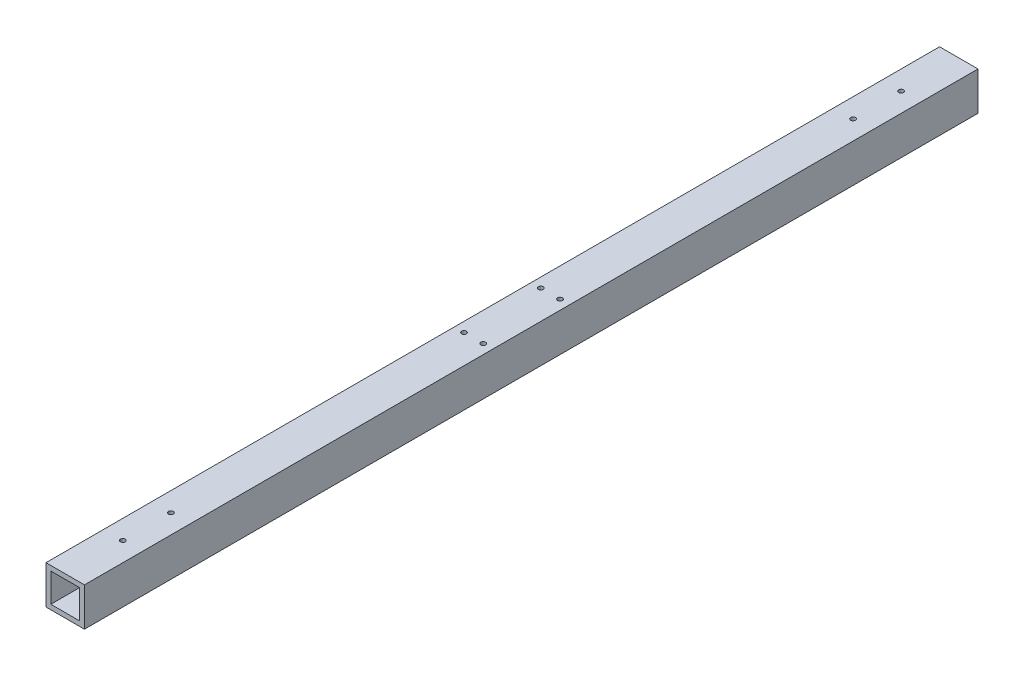
ISO-10303-21;
HEADER;
FILE_DESCRIPTION(('STEP AP214'),'2;1');
FILE_NAME('part.step','',(''),(''),'','','');
FILE_SCHEMA(('AUTOMOTIVE_DESIGN { 1 0 10303 214 1 1 1 1 }'));
ENDSEC;
DATA;
#1=APPLICATION_CONTEXT('core data for automotive mechanical design processes');
#2=APPLICATION_PROTOCOL_DEFINITION('international standard','automotive_design',2000,#1);
#3=PRODUCT_CONTEXT('',#1,'mechanical');
#4=PRODUCT('Part','Part','',(#3));
#5=PRODUCT_RELATED_PRODUCT_CATEGORY('part','',(#4));
#6=PRODUCT_DEFINITION_FORMATION('','',#4);
#7=PRODUCT_DEFINITION_CONTEXT('part definition',#1,'design');
#8=PRODUCT_DEFINITION('design','',#6,#7);
#9=PRODUCT_DEFINITION_SHAPE('','',#8);
#10=(LENGTH_UNIT() NAMED_UNIT(*) SI_UNIT(.MILLI.,.METRE.));
#11=(NAMED_UNIT(*) PLANE_ANGLE_UNIT() SI_UNIT($,.RADIAN.));
#12=(NAMED_UNIT(*) SI_UNIT($,.STERADIAN.) SOLID_ANGLE_UNIT());
#13=UNCERTAINTY_MEASURE_WITH_UNIT(LENGTH_MEASURE(1.E-05),#10,'distance_accuracy_value','');
#14=(GEOMETRIC_REPRESENTATION_CONTEXT(3) GLOBAL_UNCERTAINTY_ASSIGNED_CONTEXT((#13)) GLOBAL_UNIT_ASSIGNED_CONTEXT((#10,
#11,#12)) REPRESENTATION_CONTEXT('',''));
#15=CARTESIAN_POINT('',(0.,0.,0.));
#16=DIRECTION('',(0.,0.,1.));
#17=DIRECTION('',(1.,0.,0.));
#18=AXIS2_PLACEMENT_3D('',#15,#16,#17);
#19=CARTESIAN_POINT('',(25.4,-25.4,1181.1));
#20=DIRECTION('',(0.,-1.,0.));
#21=DIRECTION('',(1.,0.,0.));
#22=AXIS2_PLACEMENT_3D('',#19,#20,#21);
#23=PLANE('',#22);
#24=CARTESIAN_POINT('',(0.,-25.4,1104.9));
#25=DIRECTION('',(0.,1.,0.));
#26=DIRECTION('',(0.,0.,1.));
#27=AXIS2_PLACEMENT_3D('',#24,#25,#26);
#28=CIRCLE('',#27,3.17499999999999);
#29=CARTESIAN_POINT('',(0.,-25.4,1108.075));
#30=VERTEX_POINT('',#29);
#31=EDGE_CURVE('E352',#30,#30,#28,.T.);
#32=ORIENTED_EDGE('',*,*,#31,.T.);
#33=EDGE_LOOP('',(#32));
#34=FACE_BOUND('',#33,.T.);
#35=CARTESIAN_POINT('',(0.,-25.4,1041.4));
#36=DIRECTION('',(0.,1.,0.));
#37=DIRECTION('',(0.,0.,1.));
#38=AXIS2_PLACEMENT_3D('',#35,#36,#37);
#39=CIRCLE('',#38,3.17499999999999);
#40=CARTESIAN_POINT('',(0.,-25.4,1044.575));
#41=VERTEX_POINT('',#40);
#42=EDGE_CURVE('E192',#41,#41,#39,.T.);
#43=ORIENTED_EDGE('',*,*,#42,.T.);
#44=EDGE_LOOP('',(#43));
#45=FACE_BOUND('',#44,.T.);
#46=CARTESIAN_POINT('',(0.,-25.4,139.7));
#47=DIRECTION('',(0.,1.,0.));
#48=DIRECTION('',(0.,0.,1.));
#49=AXIS2_PLACEMENT_3D('',#46,#47,#48);
#50=CIRCLE('',#49,3.17499999999999);
#51=CARTESIAN_POINT('',(0.,-25.4,142.875));
#52=VERTEX_POINT('',#51);
#53=EDGE_CURVE('E188',#52,#52,#50,.T.);
#54=ORIENTED_EDGE('',*,*,#53,.T.);
#55=EDGE_LOOP('',(#54));
#56=FACE_BOUND('',#55,.T.);
#57=CARTESIAN_POINT('',(0.,-25.4,76.2));
#58=DIRECTION('',(0.,1.,0.));
#59=DIRECTION('',(0.,0.,1.));
#60=AXIS2_PLACEMENT_3D('',#57,#58,#59);
#61=CIRCLE('',#60,3.17499999999999);
#62=CARTESIAN_POINT('',(0.,-25.4,79.375));
#63=VERTEX_POINT('',#62);
#64=EDGE_CURVE('E184',#63,#63,#61,.T.);
#65=ORIENTED_EDGE('',*,*,#64,.T.);
#66=EDGE_LOOP('',(#65));
#67=FACE_BOUND('',#66,.T.);
#68=DIRECTION('',(-1.,0.,0.));
#69=VECTOR('',#68,1.);
#70=CARTESIAN_POINT('',(25.4,-25.4,0.));
#71=LINE('',#70,#69);
#72=CARTESIAN_POINT('',(25.4,-25.4,0.));
#73=VERTEX_POINT('',#72);
#74=CARTESIAN_POINT('',(-25.4,-25.4,0.));
#75=VERTEX_POINT('',#74);
#76=EDGE_CURVE('E159',#73,#75,#71,.T.);
#77=ORIENTED_EDGE('',*,*,#76,.F.);
#78=DIRECTION('',(0.,0.,-1.));
#79=VECTOR('',#78,1.);
#80=CARTESIAN_POINT('',(25.4,-25.4,1181.1));
#81=LINE('',#80,#79);
#82=CARTESIAN_POINT('',(25.4,-25.4,1181.1));
#83=VERTEX_POINT('',#82);
#84=EDGE_CURVE('E156',#83,#73,#81,.T.);
#85=ORIENTED_EDGE('',*,*,#84,.F.);
#86=DIRECTION('',(-1.,0.,0.));
#87=VECTOR('',#86,1.);
#88=CARTESIAN_POINT('',(25.4,-25.4,1181.1));
#89=LINE('',#88,#87);
#90=CARTESIAN_POINT('',(-25.4,-25.4,1181.1));
#91=VERTEX_POINT('',#90);
#92=EDGE_CURVE('E148',#83,#91,#89,.T.);
#93=ORIENTED_EDGE('',*,*,#92,.T.);
#94=DIRECTION('',(0.,0.,-1.));
#95=VECTOR('',#94,1.);
#96=CARTESIAN_POINT('',(-25.4,-25.4,1181.1));
#97=LINE('',#96,#95);
#98=EDGE_CURVE('E168',#91,#75,#97,.T.);
#99=ORIENTED_EDGE('',*,*,#98,.T.);
#100=EDGE_LOOP('',(#77,#85,#93,#99));
#101=FACE_BOUND('',#100,.T.);
#102=CARTESIAN_POINT('',(-12.7,-25.4,539.75));
#103=DIRECTION('',(0.,1.,0.));
#104=DIRECTION('',(0.,0.,1.));
#105=AXIS2_PLACEMENT_3D('',#102,#103,#104);
#106=CIRCLE('',#105,3.17499999999999);
#107=CARTESIAN_POINT('',(-12.7,-25.4,542.925));
#108=VERTEX_POINT('',#107);
#109=EDGE_CURVE('E174',#108,#108,#106,.T.);
#110=ORIENTED_EDGE('',*,*,#109,.T.);
#111=EDGE_LOOP('',(#110));
#112=FACE_BOUND('',#111,.T.);
#113=CARTESIAN_POINT('',(12.7,-25.4,539.75));
#114=DIRECTION('',(0.,1.,0.));
#115=DIRECTION('',(0.,0.,1.));
#116=AXIS2_PLACEMENT_3D('',#113,#114,#115);
#117=CIRCLE('',#116,3.17499999999999);
#118=CARTESIAN_POINT('',(12.7,-25.4,542.925));
#119=VERTEX_POINT('',#118);
#120=EDGE_CURVE('E243',#119,#119,#117,.T.);
#121=ORIENTED_EDGE('',*,*,#120,.T.);
#122=EDGE_LOOP('',(#121));
#123=FACE_BOUND('',#122,.T.);
#124=CARTESIAN_POINT('',(12.7,-25.4,641.35));
#125=DIRECTION('',(0.,1.,0.));
#126=DIRECTION('',(0.,0.,1.));
#127=AXIS2_PLACEMENT_3D('',#124,#125,#126);
#128=CIRCLE('',#127,3.17499999999999);
#129=CARTESIAN_POINT('',(12.7,-25.4,644.525));
#130=VERTEX_POINT('',#129);
#131=EDGE_CURVE('E231',#130,#130,#128,.T.);
#132=ORIENTED_EDGE('',*,*,#131,.T.);
#133=EDGE_LOOP('',(#132));
#134=FACE_BOUND('',#133,.T.);
#135=CARTESIAN_POINT('',(-12.7,-25.4,641.35));
#136=DIRECTION('',(0.,1.,0.));
#137=DIRECTION('',(0.,0.,1.));
#138=AXIS2_PLACEMENT_3D('',#135,#136,#137);
#139=CIRCLE('',#138,3.17499999999999);
#140=CARTESIAN_POINT('',(-12.7,-25.4,644.525));
#141=VERTEX_POINT('',#140);
#142=EDGE_CURVE('E179',#141,#141,#139,.T.);
#143=ORIENTED_EDGE('',*,*,#142,.T.);
#144=EDGE_LOOP('',(#143));
#145=FACE_BOUND('',#144,.T.);
#146=ADVANCED_FACE('F39',(#34,#45,#56,#67,#101,#112,#123,#134,#145),#23,.T.);
#147=CARTESIAN_POINT('',(25.4,25.4,1181.1));
#148=DIRECTION('',(0.,-1.,0.));
#149=DIRECTION('',(1.,0.,0.));
#150=AXIS2_PLACEMENT_3D('',#147,#148,#149);
#151=PLANE('',#150);
#152=CARTESIAN_POINT('',(0.,25.4,1104.9));
#153=DIRECTION('',(0.,1.,0.));
#154=DIRECTION('',(0.,0.,1.));
#155=AXIS2_PLACEMENT_3D('',#152,#153,#154);
#156=CIRCLE('',#155,3.17499999999999);
#157=CARTESIAN_POINT('',(0.,25.4,1108.075));
#158=VERTEX_POINT('',#157);
#159=EDGE_CURVE('E350',#158,#158,#156,.T.);
#160=ORIENTED_EDGE('',*,*,#159,.F.);
#161=EDGE_LOOP('',(#160));
#162=FACE_BOUND('',#161,.T.);
#163=CARTESIAN_POINT('',(0.,25.4,1041.4));
#164=DIRECTION('',(0.,1.,0.));
#165=DIRECTION('',(0.,0.,1.));
#166=AXIS2_PLACEMENT_3D('',#163,#164,#165);
#167=CIRCLE('',#166,3.17499999999999);
#168=CARTESIAN_POINT('',(0.,25.4,1044.575));
#169=VERTEX_POINT('',#168);
#170=EDGE_CURVE('E199',#169,#169,#167,.T.);
#171=ORIENTED_EDGE('',*,*,#170,.F.);
#172=EDGE_LOOP('',(#171));
#173=FACE_BOUND('',#172,.T.);
#174=CARTESIAN_POINT('',(0.,25.4,139.7));
#175=DIRECTION('',(0.,1.,0.));
#176=DIRECTION('',(0.,0.,1.));
#177=AXIS2_PLACEMENT_3D('',#174,#175,#176);
#178=CIRCLE('',#177,3.17499999999999);
#179=CARTESIAN_POINT('',(0.,25.4,142.875));
#180=VERTEX_POINT('',#179);
#181=EDGE_CURVE('E196',#180,#180,#178,.T.);
#182=ORIENTED_EDGE('',*,*,#181,.F.);
#183=EDGE_LOOP('',(#182));
#184=FACE_BOUND('',#183,.T.);
#185=CARTESIAN_POINT('',(0.,25.4,76.2));
#186=DIRECTION('',(0.,1.,0.));
#187=DIRECTION('',(0.,0.,1.));
#188=AXIS2_PLACEMENT_3D('',#185,#186,#187);
#189=CIRCLE('',#188,3.17499999999999);
#190=CARTESIAN_POINT('',(0.,25.4,79.375));
#191=VERTEX_POINT('',#190);
#192=EDGE_CURVE('E214',#191,#191,#189,.T.);
#193=ORIENTED_EDGE('',*,*,#192,.F.);
#194=EDGE_LOOP('',(#193));
#195=FACE_BOUND('',#194,.T.);
#196=CARTESIAN_POINT('',(-12.7,25.4,641.35));
#197=DIRECTION('',(0.,1.,0.));
#198=DIRECTION('',(0.,0.,1.));
#199=AXIS2_PLACEMENT_3D('',#196,#197,#198);
#200=CIRCLE('',#199,3.175);
#201=CARTESIAN_POINT('',(-12.7,25.4,644.525));
#202=VERTEX_POINT('',#201);
#203=EDGE_CURVE('E221',#202,#202,#200,.T.);
#204=ORIENTED_EDGE('',*,*,#203,.F.);
#205=EDGE_LOOP('',(#204));
#206=FACE_BOUND('',#205,.T.);
#207=CARTESIAN_POINT('',(12.7,25.4,641.35));
#208=DIRECTION('',(0.,1.,0.));
#209=DIRECTION('',(0.,0.,1.));
#210=AXIS2_PLACEMENT_3D('',#207,#208,#209);
#211=CIRCLE('',#210,3.175);
#212=CARTESIAN_POINT('',(12.7,25.4,644.525));
#213=VERTEX_POINT('',#212);
#214=EDGE_CURVE('E228',#213,#213,#211,.T.);
#215=ORIENTED_EDGE('',*,*,#214,.F.);
#216=EDGE_LOOP('',(#215));
#217=FACE_BOUND('',#216,.T.);
#218=CARTESIAN_POINT('',(-12.7,25.4,539.75));
#219=DIRECTION('',(0.,1.,0.));
#220=DIRECTION('',(0.,0.,1.));
#221=AXIS2_PLACEMENT_3D('',#218,#219,#220);
#222=CIRCLE('',#221,3.175);
#223=CARTESIAN_POINT('',(-12.7,25.4,542.925));
#224=VERTEX_POINT('',#223);
#225=EDGE_CURVE('E252',#224,#224,#222,.T.);
#226=ORIENTED_EDGE('',*,*,#225,.F.);
#227=EDGE_LOOP('',(#226));
#228=FACE_BOUND('',#227,.T.);
#229=DIRECTION('',(-1.,0.,0.));
#230=VECTOR('',#229,1.);
#231=CARTESIAN_POINT('',(25.4,25.4,0.));
#232=LINE('',#231,#230);
#233=CARTESIAN_POINT('',(25.4,25.4,0.));
#234=VERTEX_POINT('',#233);
#235=CARTESIAN_POINT('',(-25.4,25.4,0.));
#236=VERTEX_POINT('',#235);
#237=EDGE_CURVE('E149',#234,#236,#232,.T.);
#238=ORIENTED_EDGE('',*,*,#237,.T.);
#239=DIRECTION('',(0.,0.,-1.));
#240=VECTOR('',#239,1.);
#241=CARTESIAN_POINT('',(-25.4,25.4,1181.1));
#242=LINE('',#241,#240);
#243=CARTESIAN_POINT('',(-25.4,25.4,1181.1));
#244=VERTEX_POINT('',#243);
#245=EDGE_CURVE('E48',#244,#236,#242,.T.);
#246=ORIENTED_EDGE('',*,*,#245,.F.);
#247=DIRECTION('',(-1.,0.,0.));
#248=VECTOR('',#247,1.);
#249=CARTESIAN_POINT('',(25.4,25.4,1181.1));
#250=LINE('',#249,#248);
#251=CARTESIAN_POINT('',(25.4,25.4,1181.1));
#252=VERTEX_POINT('',#251);
#253=EDGE_CURVE('E154',#252,#244,#250,.T.);
#254=ORIENTED_EDGE('',*,*,#253,.F.);
#255=DIRECTION('',(0.,0.,-1.));
#256=VECTOR('',#255,1.);
#257=CARTESIAN_POINT('',(25.4,25.4,1181.1));
#258=LINE('',#257,#256);
#259=EDGE_CURVE('E11',#252,#234,#258,.T.);
#260=ORIENTED_EDGE('',*,*,#259,.T.);
#261=EDGE_LOOP('',(#238,#246,#254,#260));
#262=FACE_BOUND('',#261,.T.);
#263=CARTESIAN_POINT('',(12.7,25.4,539.75));
#264=DIRECTION('',(0.,1.,0.));
#265=DIRECTION('',(0.,0.,1.));
#266=AXIS2_PLACEMENT_3D('',#263,#264,#265);
#267=CIRCLE('',#266,3.175);
#268=CARTESIAN_POINT('',(12.7,25.4,542.925));
#269=VERTEX_POINT('',#268);
#270=EDGE_CURVE('E240',#269,#269,#267,.T.);
#271=ORIENTED_EDGE('',*,*,#270,.F.);
#272=EDGE_LOOP('',(#271));
#273=FACE_BOUND('',#272,.T.);
#274=ADVANCED_FACE('F279',(#162,#173,#184,#195,#206,#217,#228,#262,#273),#151,.F.);
#275=CARTESIAN_POINT('',(25.4,25.4,1181.1));
#276=DIRECTION('',(1.,0.,0.));
#277=DIRECTION('',(0.,1.,0.));
#278=AXIS2_PLACEMENT_3D('',#275,#276,#277);
#279=PLANE('',#278);
#280=DIRECTION('',(0.,-1.,0.));
#281=VECTOR('',#280,1.);
#282=CARTESIAN_POINT('',(25.4,25.4,0.));
#283=LINE('',#282,#281);
#284=EDGE_CURVE('E141',#234,#73,#283,.T.);
#285=ORIENTED_EDGE('',*,*,#284,.F.);
#286=ORIENTED_EDGE('',*,*,#259,.F.);
#287=DIRECTION('',(0.,-1.,0.));
#288=VECTOR('',#287,1.);
#289=CARTESIAN_POINT('',(25.4,25.4,1181.1));
#290=LINE('',#289,#288);
#291=EDGE_CURVE('E145',#252,#83,#290,.T.);
#292=ORIENTED_EDGE('',*,*,#291,.T.);
#293=ORIENTED_EDGE('',*,*,#84,.T.);
#294=EDGE_LOOP('',(#285,#286,#292,#293));
#295=FACE_BOUND('',#294,.T.);
#296=ADVANCED_FACE('F41',(#295),#279,.T.);
#297=CARTESIAN_POINT('',(-25.4,25.4,1181.1));
#298=DIRECTION('',(1.,0.,0.));
#299=DIRECTION('',(0.,1.,0.));
#300=AXIS2_PLACEMENT_3D('',#297,#298,#299);
#301=PLANE('',#300);
#302=DIRECTION('',(0.,-1.,0.));
#303=VECTOR('',#302,1.);
#304=CARTESIAN_POINT('',(-25.4,25.4,0.));
#305=LINE('',#304,#303);
#306=EDGE_CURVE('E162',#236,#75,#305,.T.);
#307=ORIENTED_EDGE('',*,*,#306,.T.);
#308=ORIENTED_EDGE('',*,*,#98,.F.);
#309=DIRECTION('',(0.,-1.,0.));
#310=VECTOR('',#309,1.);
#311=CARTESIAN_POINT('',(-25.4,25.4,1181.1));
#312=LINE('',#311,#310);
#313=EDGE_CURVE('E152',#244,#91,#312,.T.);
#314=ORIENTED_EDGE('',*,*,#313,.F.);
#315=ORIENTED_EDGE('',*,*,#245,.T.);
#316=EDGE_LOOP('',(#307,#308,#314,#315));
#317=FACE_BOUND('',#316,.T.);
#318=ADVANCED_FACE('F288',(#317),#301,.F.);
#319=CARTESIAN_POINT('',(0.,0.,1181.1));
#320=DIRECTION('',(0.,0.,-1.));
#321=DIRECTION('',(-1.,0.,0.));
#322=AXIS2_PLACEMENT_3D('',#319,#320,#321);
#323=PLANE('',#322);
#324=DIRECTION('',(1.,0.,0.));
#325=VECTOR('',#324,1.);
#326=CARTESIAN_POINT('',(19.05,-19.05,1181.1));
#327=LINE('',#326,#325);
#328=CARTESIAN_POINT('',(-19.05,-19.05,1181.1));
#329=VERTEX_POINT('',#328);
#330=CARTESIAN_POINT('',(19.05,-19.05,1181.1));
#331=VERTEX_POINT('',#330);
#332=EDGE_CURVE('E135',#329,#331,#327,.T.);
#333=ORIENTED_EDGE('',*,*,#332,.F.);
#334=DIRECTION('',(0.,-1.,0.));
#335=VECTOR('',#334,1.);
#336=CARTESIAN_POINT('',(-19.05,-19.05,1181.1));
#337=LINE('',#336,#335);
#338=CARTESIAN_POINT('',(-19.05,19.05,1181.1));
#339=VERTEX_POINT('',#338);
#340=EDGE_CURVE('E56',#339,#329,#337,.T.);
#341=ORIENTED_EDGE('',*,*,#340,.F.);
#342=DIRECTION('',(-1.,0.,0.));
#343=VECTOR('',#342,1.);
#344=CARTESIAN_POINT('',(19.05,19.05,1181.1));
#345=LINE('',#344,#343);
#346=CARTESIAN_POINT('',(19.05,19.05,1181.1));
#347=VERTEX_POINT('',#346);
#348=EDGE_CURVE('E123',#347,#339,#345,.T.);
#349=ORIENTED_EDGE('',*,*,#348,.F.);
#350=DIRECTION('',(0.,1.,0.));
#351=VECTOR('',#350,1.);
#352=CARTESIAN_POINT('',(19.05,-19.05,1181.1));
#353=LINE('',#352,#351);
#354=EDGE_CURVE('E126',#331,#347,#353,.T.);
#355=ORIENTED_EDGE('',*,*,#354,.F.);
#356=EDGE_LOOP('',(#333,#341,#349,#355));
#357=FACE_BOUND('',#356,.T.);
#358=ORIENTED_EDGE('',*,*,#291,.F.);
#359=ORIENTED_EDGE('',*,*,#253,.T.);
#360=ORIENTED_EDGE('',*,*,#313,.T.);
#361=ORIENTED_EDGE('',*,*,#92,.F.);
#362=EDGE_LOOP('',(#358,#359,#360,#361));
#363=FACE_BOUND('',#362,.T.);
#364=ADVANCED_FACE('F290',(#357,#363),#323,.F.);
#365=CARTESIAN_POINT('',(0.,0.,0.));
#366=DIRECTION('',(0.,0.,-1.));
#367=DIRECTION('',(-1.,0.,0.));
#368=AXIS2_PLACEMENT_3D('',#365,#366,#367);
#369=PLANE('',#368);
#370=DIRECTION('',(0.,-1.,0.));
#371=VECTOR('',#370,1.);
#372=CARTESIAN_POINT('',(-19.05,-19.05,0.));
#373=LINE('',#372,#371);
#374=CARTESIAN_POINT('',(-19.05,19.05,0.));
#375=VERTEX_POINT('',#374);
#376=CARTESIAN_POINT('',(-19.05,-19.05,0.));
#377=VERTEX_POINT('',#376);
#378=EDGE_CURVE('E107',#375,#377,#373,.T.);
#379=ORIENTED_EDGE('',*,*,#378,.T.);
#380=DIRECTION('',(1.,0.,0.));
#381=VECTOR('',#380,1.);
#382=CARTESIAN_POINT('',(19.05,-19.05,0.));
#383=LINE('',#382,#381);
#384=CARTESIAN_POINT('',(19.05,-19.05,0.));
#385=VERTEX_POINT('',#384);
#386=EDGE_CURVE('E116',#377,#385,#383,.T.);
#387=ORIENTED_EDGE('',*,*,#386,.T.);
#388=DIRECTION('',(0.,1.,0.));
#389=VECTOR('',#388,1.);
#390=CARTESIAN_POINT('',(19.05,-19.05,0.));
#391=LINE('',#390,#389);
#392=CARTESIAN_POINT('',(19.05,19.05,0.));
#393=VERTEX_POINT('',#392);
#394=EDGE_CURVE('E64',#385,#393,#391,.T.);
#395=ORIENTED_EDGE('',*,*,#394,.T.);
#396=DIRECTION('',(-1.,0.,0.));
#397=VECTOR('',#396,1.);
#398=CARTESIAN_POINT('',(19.05,19.05,0.));
#399=LINE('',#398,#397);
#400=EDGE_CURVE('E113',#393,#375,#399,.T.);
#401=ORIENTED_EDGE('',*,*,#400,.T.);
#402=EDGE_LOOP('',(#379,#387,#395,#401));
#403=FACE_BOUND('',#402,.T.);
#404=ORIENTED_EDGE('',*,*,#284,.T.);
#405=ORIENTED_EDGE('',*,*,#76,.T.);
#406=ORIENTED_EDGE('',*,*,#306,.F.);
#407=ORIENTED_EDGE('',*,*,#237,.F.);
#408=EDGE_LOOP('',(#404,#405,#406,#407));
#409=FACE_BOUND('',#408,.T.);
#410=ADVANCED_FACE('F120',(#403,#409),#369,.T.);
#411=CARTESIAN_POINT('',(-19.05,-19.05,0.));
#412=DIRECTION('',(-1.,0.,0.));
#413=DIRECTION('',(0.,0.,1.));
#414=AXIS2_PLACEMENT_3D('',#411,#412,#413);
#415=PLANE('',#414);
#416=ORIENTED_EDGE('',*,*,#340,.T.);
#417=DIRECTION('',(0.,0.,1.));
#418=VECTOR('',#417,1.);
#419=CARTESIAN_POINT('',(-19.05,-19.05,0.));
#420=LINE('',#419,#418);
#421=EDGE_CURVE('E103',#377,#329,#420,.T.);
#422=ORIENTED_EDGE('',*,*,#421,.F.);
#423=ORIENTED_EDGE('',*,*,#378,.F.);
#424=DIRECTION('',(0.,0.,1.));
#425=VECTOR('',#424,1.);
#426=CARTESIAN_POINT('',(-19.05,19.05,0.));
#427=LINE('',#426,#425);
#428=EDGE_CURVE('E139',#375,#339,#427,.T.);
#429=ORIENTED_EDGE('',*,*,#428,.T.);
#430=EDGE_LOOP('',(#416,#422,#423,#429));
#431=FACE_BOUND('',#430,.T.);
#432=ADVANCED_FACE('F105',(#431),#415,.F.);
#433=CARTESIAN_POINT('',(19.05,19.05,0.));
#434=DIRECTION('',(0.,1.,0.));
#435=DIRECTION('',(0.,0.,1.));
#436=AXIS2_PLACEMENT_3D('',#433,#434,#435);
#437=PLANE('',#436);
#438=CARTESIAN_POINT('',(0.,19.05,1104.9));
#439=DIRECTION('',(0.,1.,0.));
#440=DIRECTION('',(0.,0.,1.));
#441=AXIS2_PLACEMENT_3D('',#438,#439,#440);
#442=CIRCLE('',#441,3.17499999999999);
#443=CARTESIAN_POINT('',(0.,19.05,1108.075));
#444=VERTEX_POINT('',#443);
#445=EDGE_CURVE('E204',#444,#444,#442,.T.);
#446=ORIENTED_EDGE('',*,*,#445,.T.);
#447=EDGE_LOOP('',(#446));
#448=FACE_BOUND('',#447,.T.);
#449=CARTESIAN_POINT('',(0.,19.05,1041.4));
#450=DIRECTION('',(0.,1.,0.));
#451=DIRECTION('',(0.,0.,1.));
#452=AXIS2_PLACEMENT_3D('',#449,#450,#451);
#453=CIRCLE('',#452,3.17499999999999);
#454=CARTESIAN_POINT('',(0.,19.05,1044.575));
#455=VERTEX_POINT('',#454);
#456=EDGE_CURVE('E189',#455,#455,#453,.T.);
#457=ORIENTED_EDGE('',*,*,#456,.T.);
#458=EDGE_LOOP('',(#457));
#459=FACE_BOUND('',#458,.T.);
#460=CARTESIAN_POINT('',(0.,19.05,139.7));
#461=DIRECTION('',(0.,1.,0.));
#462=DIRECTION('',(0.,0.,1.));
#463=AXIS2_PLACEMENT_3D('',#460,#461,#462);
#464=CIRCLE('',#463,3.17499999999999);
#465=CARTESIAN_POINT('',(0.,19.05,142.875));
#466=VERTEX_POINT('',#465);
#467=EDGE_CURVE('E185',#466,#466,#464,.T.);
#468=ORIENTED_EDGE('',*,*,#467,.T.);
#469=EDGE_LOOP('',(#468));
#470=FACE_BOUND('',#469,.T.);
#471=CARTESIAN_POINT('',(0.,19.05,76.2));
#472=DIRECTION('',(0.,1.,0.));
#473=DIRECTION('',(0.,0.,1.));
#474=AXIS2_PLACEMENT_3D('',#471,#472,#473);
#475=CIRCLE('',#474,3.17499999999999);
#476=CARTESIAN_POINT('',(0.,19.05,79.375));
#477=VERTEX_POINT('',#476);
#478=EDGE_CURVE('E183',#477,#477,#475,.T.);
#479=ORIENTED_EDGE('',*,*,#478,.T.);
#480=EDGE_LOOP('',(#479));
#481=FACE_BOUND('',#480,.T.);
#482=CARTESIAN_POINT('',(-12.7,19.05,641.35));
#483=DIRECTION('',(0.,1.,0.));
#484=DIRECTION('',(0.,0.,1.));
#485=AXIS2_PLACEMENT_3D('',#482,#483,#484);
#486=CIRCLE('',#485,3.175);
#487=CARTESIAN_POINT('',(-12.7,19.05,644.525));
#488=VERTEX_POINT('',#487);
#489=EDGE_CURVE('E178',#488,#488,#486,.T.);
#490=ORIENTED_EDGE('',*,*,#489,.T.);
#491=EDGE_LOOP('',(#490));
#492=FACE_BOUND('',#491,.T.);
#493=CARTESIAN_POINT('',(12.7,19.05,641.35));
#494=DIRECTION('',(0.,1.,0.));
#495=DIRECTION('',(0.,0.,1.));
#496=AXIS2_PLACEMENT_3D('',#493,#494,#495);
#497=CIRCLE('',#496,3.175);
#498=CARTESIAN_POINT('',(12.7,19.05,644.525));
#499=VERTEX_POINT('',#498);
#500=EDGE_CURVE('E234',#499,#499,#497,.T.);
#501=ORIENTED_EDGE('',*,*,#500,.T.);
#502=EDGE_LOOP('',(#501));
#503=FACE_BOUND('',#502,.T.);
#504=CARTESIAN_POINT('',(12.7,19.05,539.75));
#505=DIRECTION('',(0.,1.,0.));
#506=DIRECTION('',(0.,0.,1.));
#507=AXIS2_PLACEMENT_3D('',#504,#505,#506);
#508=CIRCLE('',#507,3.175);
#509=CARTESIAN_POINT('',(12.7,19.05,542.925));
#510=VERTEX_POINT('',#509);
#511=EDGE_CURVE('E249',#510,#510,#508,.T.);
#512=ORIENTED_EDGE('',*,*,#511,.T.);
#513=EDGE_LOOP('',(#512));
#514=FACE_BOUND('',#513,.T.);
#515=CARTESIAN_POINT('',(-12.7,19.05,539.75));
#516=DIRECTION('',(0.,1.,0.));
#517=DIRECTION('',(0.,0.,1.));
#518=AXIS2_PLACEMENT_3D('',#515,#516,#517);
#519=CIRCLE('',#518,3.175);
#520=CARTESIAN_POINT('',(-12.7,19.05,542.925));
#521=VERTEX_POINT('',#520);
#522=EDGE_CURVE('E129',#521,#521,#519,.T.);
#523=ORIENTED_EDGE('',*,*,#522,.T.);
#524=EDGE_LOOP('',(#523));
#525=FACE_BOUND('',#524,.T.);
#526=ORIENTED_EDGE('',*,*,#348,.T.);
#527=ORIENTED_EDGE('',*,*,#428,.F.);
#528=ORIENTED_EDGE('',*,*,#400,.F.);
#529=DIRECTION('',(0.,0.,1.));
#530=VECTOR('',#529,1.);
#531=CARTESIAN_POINT('',(19.05,19.05,0.));
#532=LINE('',#531,#530);
#533=EDGE_CURVE('E142',#393,#347,#532,.T.);
#534=ORIENTED_EDGE('',*,*,#533,.T.);
#535=EDGE_LOOP('',(#526,#527,#528,#534));
#536=FACE_BOUND('',#535,.T.);
#537=ADVANCED_FACE('F273',(#448,#459,#470,#481,#492,#503,#514,#525,#536),#437,.F.);
#538=CARTESIAN_POINT('',(19.05,-19.05,0.));
#539=DIRECTION('',(1.,0.,0.));
#540=DIRECTION('',(0.,0.,-1.));
#541=AXIS2_PLACEMENT_3D('',#538,#539,#540);
#542=PLANE('',#541);
#543=ORIENTED_EDGE('',*,*,#354,.T.);
#544=ORIENTED_EDGE('',*,*,#533,.F.);
#545=ORIENTED_EDGE('',*,*,#394,.F.);
#546=DIRECTION('',(0.,0.,1.));
#547=VECTOR('',#546,1.);
#548=CARTESIAN_POINT('',(19.05,-19.05,0.));
#549=LINE('',#548,#547);
#550=EDGE_CURVE('E112',#385,#331,#549,.T.);
#551=ORIENTED_EDGE('',*,*,#550,.T.);
#552=EDGE_LOOP('',(#543,#544,#545,#551));
#553=FACE_BOUND('',#552,.T.);
#554=ADVANCED_FACE('F267',(#553),#542,.F.);
#555=CARTESIAN_POINT('',(19.05,-19.05,0.));
#556=DIRECTION('',(0.,-1.,0.));
#557=DIRECTION('',(0.,0.,-1.));
#558=AXIS2_PLACEMENT_3D('',#555,#556,#557);
#559=PLANE('',#558);
#560=CARTESIAN_POINT('',(0.,-19.05,1104.9));
#561=DIRECTION('',(0.,-1.,0.));
#562=DIRECTION('',(0.,0.,-1.));
#563=AXIS2_PLACEMENT_3D('',#560,#561,#562);
#564=CIRCLE('',#563,3.17499999999999);
#565=CARTESIAN_POINT('',(0.,-19.05,1101.725));
#566=VERTEX_POINT('',#565);
#567=EDGE_CURVE('E43',#566,#566,#564,.T.);
#568=ORIENTED_EDGE('',*,*,#567,.T.);
#569=EDGE_LOOP('',(#568));
#570=FACE_BOUND('',#569,.T.);
#571=CARTESIAN_POINT('',(0.,-19.05,1041.4));
#572=DIRECTION('',(0.,-1.,0.));
#573=DIRECTION('',(0.,0.,-1.));
#574=AXIS2_PLACEMENT_3D('',#571,#572,#573);
#575=CIRCLE('',#574,3.17499999999999);
#576=CARTESIAN_POINT('',(0.,-19.05,1038.225));
#577=VERTEX_POINT('',#576);
#578=EDGE_CURVE('E191',#577,#577,#575,.T.);
#579=ORIENTED_EDGE('',*,*,#578,.T.);
#580=EDGE_LOOP('',(#579));
#581=FACE_BOUND('',#580,.T.);
#582=CARTESIAN_POINT('',(0.,-19.05,139.7));
#583=DIRECTION('',(0.,-1.,0.));
#584=DIRECTION('',(0.,0.,-1.));
#585=AXIS2_PLACEMENT_3D('',#582,#583,#584);
#586=CIRCLE('',#585,3.17499999999999);
#587=CARTESIAN_POINT('',(0.,-19.05,136.525));
#588=VERTEX_POINT('',#587);
#589=EDGE_CURVE('E187',#588,#588,#586,.T.);
#590=ORIENTED_EDGE('',*,*,#589,.T.);
#591=EDGE_LOOP('',(#590));
#592=FACE_BOUND('',#591,.T.);
#593=CARTESIAN_POINT('',(0.,-19.05,76.2));
#594=DIRECTION('',(0.,-1.,0.));
#595=DIRECTION('',(0.,0.,-1.));
#596=AXIS2_PLACEMENT_3D('',#593,#594,#595);
#597=CIRCLE('',#596,3.17499999999999);
#598=CARTESIAN_POINT('',(0.,-19.05,73.0250000000001));
#599=VERTEX_POINT('',#598);
#600=EDGE_CURVE('E180',#599,#599,#597,.T.);
#601=ORIENTED_EDGE('',*,*,#600,.T.);
#602=EDGE_LOOP('',(#601));
#603=FACE_BOUND('',#602,.T.);
#604=CARTESIAN_POINT('',(-12.7,-19.05,641.35));
#605=DIRECTION('',(0.,-1.,0.));
#606=DIRECTION('',(0.,0.,-1.));
#607=AXIS2_PLACEMENT_3D('',#604,#605,#606);
#608=CIRCLE('',#607,3.175);
#609=CARTESIAN_POINT('',(-12.7,-19.05,638.175));
#610=VERTEX_POINT('',#609);
#611=EDGE_CURVE('E175',#610,#610,#608,.T.);
#612=ORIENTED_EDGE('',*,*,#611,.T.);
#613=EDGE_LOOP('',(#612));
#614=FACE_BOUND('',#613,.T.);
#615=CARTESIAN_POINT('',(12.7,-19.05,641.35));
#616=DIRECTION('',(0.,-1.,0.));
#617=DIRECTION('',(0.,0.,-1.));
#618=AXIS2_PLACEMENT_3D('',#615,#616,#617);
#619=CIRCLE('',#618,3.175);
#620=CARTESIAN_POINT('',(12.7,-19.05,638.175));
#621=VERTEX_POINT('',#620);
#622=EDGE_CURVE('E237',#621,#621,#619,.T.);
#623=ORIENTED_EDGE('',*,*,#622,.T.);
#624=EDGE_LOOP('',(#623));
#625=FACE_BOUND('',#624,.T.);
#626=CARTESIAN_POINT('',(12.7,-19.05,539.75));
#627=DIRECTION('',(0.,-1.,0.));
#628=DIRECTION('',(0.,0.,-1.));
#629=AXIS2_PLACEMENT_3D('',#626,#627,#628);
#630=CIRCLE('',#629,3.175);
#631=CARTESIAN_POINT('',(12.7,-19.05,536.575));
#632=VERTEX_POINT('',#631);
#633=EDGE_CURVE('E246',#632,#632,#630,.T.);
#634=ORIENTED_EDGE('',*,*,#633,.T.);
#635=EDGE_LOOP('',(#634));
#636=FACE_BOUND('',#635,.T.);
#637=CARTESIAN_POINT('',(-12.7,-19.05,539.75));
#638=DIRECTION('',(0.,-1.,0.));
#639=DIRECTION('',(0.,0.,-1.));
#640=AXIS2_PLACEMENT_3D('',#637,#638,#639);
#641=CIRCLE('',#640,3.175);
#642=CARTESIAN_POINT('',(-12.7,-19.05,536.575));
#643=VERTEX_POINT('',#642);
#644=EDGE_CURVE('E171',#643,#643,#641,.T.);
#645=ORIENTED_EDGE('',*,*,#644,.T.);
#646=EDGE_LOOP('',(#645));
#647=FACE_BOUND('',#646,.T.);
#648=ORIENTED_EDGE('',*,*,#332,.T.);
#649=ORIENTED_EDGE('',*,*,#550,.F.);
#650=ORIENTED_EDGE('',*,*,#386,.F.);
#651=ORIENTED_EDGE('',*,*,#421,.T.);
#652=EDGE_LOOP('',(#648,#649,#650,#651));
#653=FACE_BOUND('',#652,.T.);
#654=ADVANCED_FACE('F117',(#570,#581,#592,#603,#614,#625,#636,#647,#653),#559,.F.);
#655=CARTESIAN_POINT('',(-12.7,25.4,539.75));
#656=DIRECTION('',(0.,1.,0.));
#657=DIRECTION('',(0.,0.,1.));
#658=AXIS2_PLACEMENT_3D('',#655,#656,#657);
#659=CYLINDRICAL_SURFACE('',#658,3.175);
#660=ORIENTED_EDGE('',*,*,#109,.F.);
#661=EDGE_LOOP('',(#660));
#662=FACE_BOUND('',#661,.T.);
#663=ORIENTED_EDGE('',*,*,#644,.F.);
#664=EDGE_LOOP('',(#663));
#665=FACE_BOUND('',#664,.T.);
#666=ADVANCED_FACE('F259',(#662,#665),#659,.F.);
#667=ORIENTED_EDGE('',*,*,#225,.T.);
#668=EDGE_LOOP('',(#667));
#669=FACE_BOUND('',#668,.T.);
#670=ORIENTED_EDGE('',*,*,#522,.F.);
#671=EDGE_LOOP('',(#670));
#672=FACE_BOUND('',#671,.T.);
#673=ADVANCED_FACE('F262',(#669,#672),#659,.F.);
#674=CARTESIAN_POINT('',(12.7,25.4,539.75));
#675=DIRECTION('',(0.,1.,0.));
#676=DIRECTION('',(0.,0.,1.));
#677=AXIS2_PLACEMENT_3D('',#674,#675,#676);
#678=CYLINDRICAL_SURFACE('',#677,3.175);
#679=ORIENTED_EDGE('',*,*,#120,.F.);
#680=EDGE_LOOP('',(#679));
#681=FACE_BOUND('',#680,.T.);
#682=ORIENTED_EDGE('',*,*,#633,.F.);
#683=EDGE_LOOP('',(#682));
#684=FACE_BOUND('',#683,.T.);
#685=ADVANCED_FACE('F308',(#681,#684),#678,.F.);
#686=ORIENTED_EDGE('',*,*,#270,.T.);
#687=EDGE_LOOP('',(#686));
#688=FACE_BOUND('',#687,.T.);
#689=ORIENTED_EDGE('',*,*,#511,.F.);
#690=EDGE_LOOP('',(#689));
#691=FACE_BOUND('',#690,.T.);
#692=ADVANCED_FACE('F310',(#688,#691),#678,.F.);
#693=CARTESIAN_POINT('',(12.7,25.4,641.35));
#694=DIRECTION('',(0.,1.,0.));
#695=DIRECTION('',(0.,0.,1.));
#696=AXIS2_PLACEMENT_3D('',#693,#694,#695);
#697=CYLINDRICAL_SURFACE('',#696,3.175);
#698=ORIENTED_EDGE('',*,*,#131,.F.);
#699=EDGE_LOOP('',(#698));
#700=FACE_BOUND('',#699,.T.);
#701=ORIENTED_EDGE('',*,*,#622,.F.);
#702=EDGE_LOOP('',(#701));
#703=FACE_BOUND('',#702,.T.);
#704=ADVANCED_FACE('F313',(#700,#703),#697,.F.);
#705=ORIENTED_EDGE('',*,*,#214,.T.);
#706=EDGE_LOOP('',(#705));
#707=FACE_BOUND('',#706,.T.);
#708=ORIENTED_EDGE('',*,*,#500,.F.);
#709=EDGE_LOOP('',(#708));
#710=FACE_BOUND('',#709,.T.);
#711=ADVANCED_FACE('F317',(#707,#710),#697,.F.);
#712=CARTESIAN_POINT('',(-12.7,25.4,641.35));
#713=DIRECTION('',(0.,1.,0.));
#714=DIRECTION('',(0.,0.,1.));
#715=AXIS2_PLACEMENT_3D('',#712,#713,#714);
#716=CYLINDRICAL_SURFACE('',#715,3.175);
#717=ORIENTED_EDGE('',*,*,#142,.F.);
#718=EDGE_LOOP('',(#717));
#719=FACE_BOUND('',#718,.T.);
#720=ORIENTED_EDGE('',*,*,#611,.F.);
#721=EDGE_LOOP('',(#720));
#722=FACE_BOUND('',#721,.T.);
#723=ADVANCED_FACE('F323',(#719,#722),#716,.F.);
#724=ORIENTED_EDGE('',*,*,#203,.T.);
#725=EDGE_LOOP('',(#724));
#726=FACE_BOUND('',#725,.T.);
#727=ORIENTED_EDGE('',*,*,#489,.F.);
#728=EDGE_LOOP('',(#727));
#729=FACE_BOUND('',#728,.T.);
#730=ADVANCED_FACE('F319',(#726,#729),#716,.F.);
#731=CARTESIAN_POINT('',(0.,25.4,76.2));
#732=DIRECTION('',(0.,1.,0.));
#733=DIRECTION('',(0.,0.,1.));
#734=AXIS2_PLACEMENT_3D('',#731,#732,#733);
#735=CYLINDRICAL_SURFACE('',#734,3.17499999999999);
#736=ORIENTED_EDGE('',*,*,#64,.F.);
#737=EDGE_LOOP('',(#736));
#738=FACE_BOUND('',#737,.T.);
#739=ORIENTED_EDGE('',*,*,#600,.F.);
#740=EDGE_LOOP('',(#739));
#741=FACE_BOUND('',#740,.T.);
#742=ADVANCED_FACE('F322',(#738,#741),#735,.F.);
#743=ORIENTED_EDGE('',*,*,#192,.T.);
#744=EDGE_LOOP('',(#743));
#745=FACE_BOUND('',#744,.T.);
#746=ORIENTED_EDGE('',*,*,#478,.F.);
#747=EDGE_LOOP('',(#746));
#748=FACE_BOUND('',#747,.T.);
#749=ADVANCED_FACE('F325',(#745,#748),#735,.F.);
#750=CARTESIAN_POINT('',(0.,25.4,139.7));
#751=DIRECTION('',(0.,1.,0.));
#752=DIRECTION('',(0.,0.,1.));
#753=AXIS2_PLACEMENT_3D('',#750,#751,#752);
#754=CYLINDRICAL_SURFACE('',#753,3.17499999999999);
#755=ORIENTED_EDGE('',*,*,#181,.T.);
#756=EDGE_LOOP('',(#755));
#757=FACE_BOUND('',#756,.T.);
#758=ORIENTED_EDGE('',*,*,#467,.F.);
#759=EDGE_LOOP('',(#758));
#760=FACE_BOUND('',#759,.T.);
#761=ADVANCED_FACE('F328',(#757,#760),#754,.F.);
#762=ORIENTED_EDGE('',*,*,#53,.F.);
#763=EDGE_LOOP('',(#762));
#764=FACE_BOUND('',#763,.T.);
#765=ORIENTED_EDGE('',*,*,#589,.F.);
#766=EDGE_LOOP('',(#765));
#767=FACE_BOUND('',#766,.T.);
#768=ADVANCED_FACE('F330',(#764,#767),#754,.F.);
#769=CARTESIAN_POINT('',(0.,25.4,1041.4));
#770=DIRECTION('',(0.,1.,0.));
#771=DIRECTION('',(0.,0.,1.));
#772=AXIS2_PLACEMENT_3D('',#769,#770,#771);
#773=CYLINDRICAL_SURFACE('',#772,3.17499999999999);
#774=ORIENTED_EDGE('',*,*,#170,.T.);
#775=EDGE_LOOP('',(#774));
#776=FACE_BOUND('',#775,.T.);
#777=ORIENTED_EDGE('',*,*,#456,.F.);
#778=EDGE_LOOP('',(#777));
#779=FACE_BOUND('',#778,.T.);
#780=ADVANCED_FACE('F333',(#776,#779),#773,.F.);
#781=ORIENTED_EDGE('',*,*,#42,.F.);
#782=EDGE_LOOP('',(#781));
#783=FACE_BOUND('',#782,.T.);
#784=ORIENTED_EDGE('',*,*,#578,.F.);
#785=EDGE_LOOP('',(#784));
#786=FACE_BOUND('',#785,.T.);
#787=ADVANCED_FACE('F335',(#783,#786),#773,.F.);
#788=CARTESIAN_POINT('',(0.,25.4,1104.9));
#789=DIRECTION('',(0.,1.,0.));
#790=DIRECTION('',(0.,0.,1.));
#791=AXIS2_PLACEMENT_3D('',#788,#789,#790);
#792=CYLINDRICAL_SURFACE('',#791,3.17499999999999);
#793=ORIENTED_EDGE('',*,*,#31,.F.);
#794=EDGE_LOOP('',(#793));
#795=FACE_BOUND('',#794,.T.);
#796=ORIENTED_EDGE('',*,*,#567,.F.);
#797=EDGE_LOOP('',(#796));
#798=FACE_BOUND('',#797,.T.);
#799=ADVANCED_FACE('F338',(#795,#798),#792,.F.);
#800=ORIENTED_EDGE('',*,*,#159,.T.);
#801=EDGE_LOOP('',(#800));
#802=FACE_BOUND('',#801,.T.);
#803=ORIENTED_EDGE('',*,*,#445,.F.);
#804=EDGE_LOOP('',(#803));
#805=FACE_BOUND('',#804,.T.);
#806=ADVANCED_FACE('F340',(#802,#805),#792,.F.);
#807=CLOSED_SHELL('',(#146,#274,#296,#318,#364,#410,#432,#537,#554,#654,#666,#673,#685,#692,
#704,#711,#723,#730,#742,#749,#761,#768,#780,#787,#799,#806));
#808=MANIFOLD_SOLID_BREP('B2',#807);
#809=ADVANCED_BREP_SHAPE_REPRESENTATION('',(#18,#808),#14);
#810=SHAPE_DEFINITION_REPRESENTATION(#9,#809);
ENDSEC;
END-ISO-10303-21;
